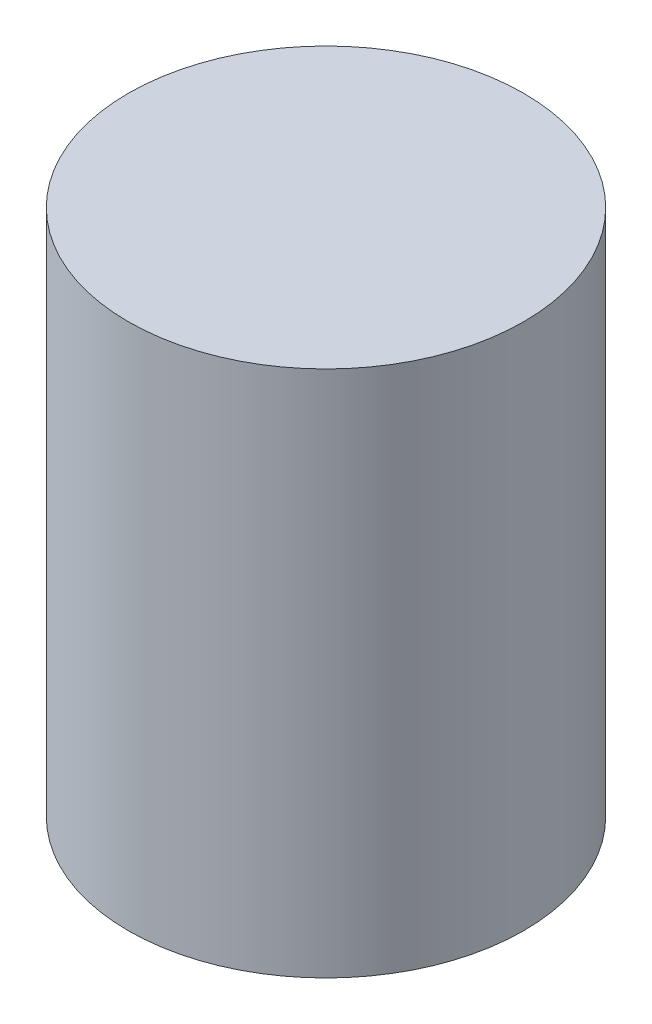
ISO-10303-21;
HEADER;
FILE_DESCRIPTION(('STEP AP214'),'2;1');
FILE_NAME('part.step','',(''),(''),'','','');
FILE_SCHEMA(('AUTOMOTIVE_DESIGN { 1 0 10303 214 1 1 1 1 }'));
ENDSEC;
DATA;
#1=APPLICATION_CONTEXT('core data for automotive mechanical design processes');
#2=APPLICATION_PROTOCOL_DEFINITION('international standard','automotive_design',2000,#1);
#3=PRODUCT_CONTEXT('',#1,'mechanical');
#4=PRODUCT('Part','Part','',(#3));
#5=PRODUCT_RELATED_PRODUCT_CATEGORY('part','',(#4));
#6=PRODUCT_DEFINITION_FORMATION('','',#4);
#7=PRODUCT_DEFINITION_CONTEXT('part definition',#1,'design');
#8=PRODUCT_DEFINITION('design','',#6,#7);
#9=PRODUCT_DEFINITION_SHAPE('','',#8);
#10=(LENGTH_UNIT() NAMED_UNIT(*) SI_UNIT(.MILLI.,.METRE.));
#11=(NAMED_UNIT(*) PLANE_ANGLE_UNIT() SI_UNIT($,.RADIAN.));
#12=(NAMED_UNIT(*) SI_UNIT($,.STERADIAN.) SOLID_ANGLE_UNIT());
#13=UNCERTAINTY_MEASURE_WITH_UNIT(LENGTH_MEASURE(1.E-05),#10,'distance_accuracy_value','');
#14=(GEOMETRIC_REPRESENTATION_CONTEXT(3) GLOBAL_UNCERTAINTY_ASSIGNED_CONTEXT((#13)) GLOBAL_UNIT_ASSIGNED_CONTEXT((#10,
#11,#12)) REPRESENTATION_CONTEXT('',''));
#15=CARTESIAN_POINT('',(0.,0.,0.));
#16=DIRECTION('',(0.,0.,1.));
#17=DIRECTION('',(1.,0.,0.));
#18=AXIS2_PLACEMENT_3D('',#15,#16,#17);
#19=CARTESIAN_POINT('',(0.,40.,0.));
#20=DIRECTION('',(0.,-1.,0.));
#21=DIRECTION('',(0.,0.,-1.));
#22=AXIS2_PLACEMENT_3D('',#19,#20,#21);
#23=CYLINDRICAL_SURFACE('',#22,15.);
#24=CARTESIAN_POINT('',(0.,40.,0.));
#25=DIRECTION('',(0.,1.,0.));
#26=DIRECTION('',(0.,0.,1.));
#27=AXIS2_PLACEMENT_3D('',#24,#25,#26);
#28=CIRCLE('',#27,15.);
#29=CARTESIAN_POINT('',(0.,40.,15.));
#30=VERTEX_POINT('',#29);
#31=EDGE_CURVE('E10',#30,#30,#28,.T.);
#32=ORIENTED_EDGE('',*,*,#31,.F.);
#33=EDGE_LOOP('',(#32));
#34=FACE_BOUND('',#33,.T.);
#35=CARTESIAN_POINT('',(0.,0.,0.));
#36=DIRECTION('',(0.,1.,0.));
#37=DIRECTION('',(0.,0.,1.));
#38=AXIS2_PLACEMENT_3D('',#35,#36,#37);
#39=CIRCLE('',#38,15.);
#40=CARTESIAN_POINT('',(0.,0.,15.));
#41=VERTEX_POINT('',#40);
#42=EDGE_CURVE('E40',#41,#41,#39,.T.);
#43=ORIENTED_EDGE('',*,*,#42,.T.);
#44=EDGE_LOOP('',(#43));
#45=FACE_BOUND('',#44,.T.);
#46=ADVANCED_FACE('F37',(#34,#45),#23,.T.);
#47=CARTESIAN_POINT('',(0.,40.,0.));
#48=DIRECTION('',(0.,1.,0.));
#49=DIRECTION('',(0.,0.,1.));
#50=AXIS2_PLACEMENT_3D('',#47,#48,#49);
#51=PLANE('',#50);
#52=ORIENTED_EDGE('',*,*,#31,.T.);
#53=EDGE_LOOP('',(#52));
#54=FACE_BOUND('',#53,.T.);
#55=ADVANCED_FACE('F54',(#54),#51,.T.);
#56=CARTESIAN_POINT('',(0.,0.,0.));
#57=DIRECTION('',(0.,1.,0.));
#58=DIRECTION('',(0.,0.,1.));
#59=AXIS2_PLACEMENT_3D('',#56,#57,#58);
#60=PLANE('',#59);
#61=ORIENTED_EDGE('',*,*,#42,.F.);
#62=EDGE_LOOP('',(#61));
#63=FACE_BOUND('',#62,.T.);
#64=ADVANCED_FACE('F52',(#63),#60,.F.);
#65=CLOSED_SHELL('',(#46,#55,#64));
#66=MANIFOLD_SOLID_BREP('B2',#65);
#67=ADVANCED_BREP_SHAPE_REPRESENTATION('',(#18,#66),#14);
#68=SHAPE_DEFINITION_REPRESENTATION(#9,#67);
ENDSEC;
END-ISO-10303-21;
